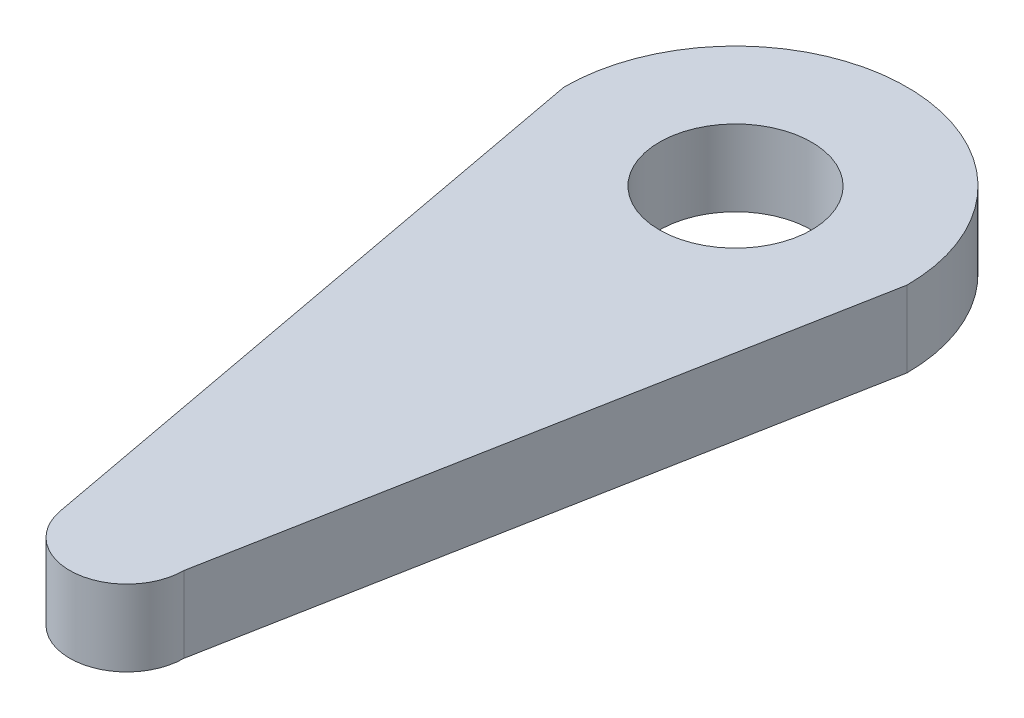
ISO-10303-21;
HEADER;
FILE_DESCRIPTION(('STEP AP214'),'2;1');
FILE_NAME('part.step','',(''),(''),'','','');
FILE_SCHEMA(('AUTOMOTIVE_DESIGN { 1 0 10303 214 1 1 1 1 }'));
ENDSEC;
DATA;
#1=APPLICATION_CONTEXT('core data for automotive mechanical design processes');
#2=APPLICATION_PROTOCOL_DEFINITION('international standard','automotive_design',2000,#1);
#3=PRODUCT_CONTEXT('',#1,'mechanical');
#4=PRODUCT('Part','Part','',(#3));
#5=PRODUCT_RELATED_PRODUCT_CATEGORY('part','',(#4));
#6=PRODUCT_DEFINITION_FORMATION('','',#4);
#7=PRODUCT_DEFINITION_CONTEXT('part definition',#1,'design');
#8=PRODUCT_DEFINITION('design','',#6,#7);
#9=PRODUCT_DEFINITION_SHAPE('','',#8);
#10=(LENGTH_UNIT() NAMED_UNIT(*) SI_UNIT(.MILLI.,.METRE.));
#11=(NAMED_UNIT(*) PLANE_ANGLE_UNIT() SI_UNIT($,.RADIAN.));
#12=(NAMED_UNIT(*) SI_UNIT($,.STERADIAN.) SOLID_ANGLE_UNIT());
#13=UNCERTAINTY_MEASURE_WITH_UNIT(LENGTH_MEASURE(1.E-05),#10,'distance_accuracy_value','');
#14=(GEOMETRIC_REPRESENTATION_CONTEXT(3) GLOBAL_UNCERTAINTY_ASSIGNED_CONTEXT((#13)) GLOBAL_UNIT_ASSIGNED_CONTEXT((#10,
#11,#12)) REPRESENTATION_CONTEXT('',''));
#15=CARTESIAN_POINT('',(0.,0.,0.));
#16=DIRECTION('',(0.,0.,1.));
#17=DIRECTION('',(1.,0.,0.));
#18=AXIS2_PLACEMENT_3D('',#15,#16,#17);
#19=CARTESIAN_POINT('',(0.,2.,0.));
#20=DIRECTION('',(0.,-1.,0.));
#21=DIRECTION('',(0.,0.,-1.));
#22=AXIS2_PLACEMENT_3D('',#19,#20,#21);
#23=CYLINDRICAL_SURFACE('',#22,4.50790916094944);
#24=CARTESIAN_POINT('',(0.,0.,0.));
#25=DIRECTION('',(0.,1.,0.));
#26=DIRECTION('',(0.,0.,1.));
#27=AXIS2_PLACEMENT_3D('',#24,#25,#26);
#28=CIRCLE('',#27,4.50790916094944);
#29=CARTESIAN_POINT('',(4.50790916094944,0.,0.));
#30=VERTEX_POINT('',#29);
#31=CARTESIAN_POINT('',(-4.50790916094944,0.,0.));
#32=VERTEX_POINT('',#31);
#33=EDGE_CURVE('E106',#30,#32,#28,.T.);
#34=ORIENTED_EDGE('',*,*,#33,.T.);
#35=DIRECTION('',(0.,-1.,0.));
#36=VECTOR('',#35,1.);
#37=CARTESIAN_POINT('',(-4.50790916094944,2.,0.));
#38=LINE('',#37,#36);
#39=CARTESIAN_POINT('',(-4.50790916094944,2.,0.));
#40=VERTEX_POINT('',#39);
#41=EDGE_CURVE('E11',#40,#32,#38,.T.);
#42=ORIENTED_EDGE('',*,*,#41,.F.);
#43=CARTESIAN_POINT('',(0.,2.,0.));
#44=DIRECTION('',(0.,1.,0.));
#45=DIRECTION('',(0.,0.,1.));
#46=AXIS2_PLACEMENT_3D('',#43,#44,#45);
#47=CIRCLE('',#46,4.50790916094944);
#48=CARTESIAN_POINT('',(4.50790916094944,2.,0.));
#49=VERTEX_POINT('',#48);
#50=EDGE_CURVE('E90',#49,#40,#47,.T.);
#51=ORIENTED_EDGE('',*,*,#50,.F.);
#52=DIRECTION('',(0.,-1.,0.));
#53=VECTOR('',#52,1.);
#54=CARTESIAN_POINT('',(4.50790916094944,2.,0.));
#55=LINE('',#54,#53);
#56=EDGE_CURVE('E102',#49,#30,#55,.T.);
#57=ORIENTED_EDGE('',*,*,#56,.T.);
#58=EDGE_LOOP('',(#34,#42,#51,#57));
#59=FACE_BOUND('',#58,.T.);
#60=ADVANCED_FACE('F38',(#59),#23,.T.);
#61=CARTESIAN_POINT('',(-4.50790916094944,2.,0.));
#62=DIRECTION('',(0.983100228081169,0.,-0.183068133619026));
#63=DIRECTION('',(-0.183068133619026,0.,-0.983100228081169));
#64=AXIS2_PLACEMENT_3D('',#61,#62,#63);
#65=PLANE('',#64);
#66=DIRECTION('',(0.183068133619026,0.,0.983100228081169));
#67=VECTOR('',#66,1.);
#68=CARTESIAN_POINT('',(-4.50790916094944,0.,0.));
#69=LINE('',#68,#67);
#70=CARTESIAN_POINT('',(-1.47724217418717,0.,16.2750848387652));
#71=VERTEX_POINT('',#70);
#72=EDGE_CURVE('E95',#32,#71,#69,.T.);
#73=ORIENTED_EDGE('',*,*,#72,.T.);
#74=DIRECTION('',(0.,-1.,0.));
#75=VECTOR('',#74,1.);
#76=CARTESIAN_POINT('',(-1.47724217418717,2.,16.2750848387652));
#77=LINE('',#76,#75);
#78=CARTESIAN_POINT('',(-1.47724217418717,2.,16.2750848387652));
#79=VERTEX_POINT('',#78);
#80=EDGE_CURVE('E47',#79,#71,#77,.T.);
#81=ORIENTED_EDGE('',*,*,#80,.F.);
#82=DIRECTION('',(0.183068133619026,0.,0.983100228081169));
#83=VECTOR('',#82,1.);
#84=CARTESIAN_POINT('',(-4.50790916094944,2.,0.));
#85=LINE('',#84,#83);
#86=EDGE_CURVE('E85',#40,#79,#85,.T.);
#87=ORIENTED_EDGE('',*,*,#86,.F.);
#88=ORIENTED_EDGE('',*,*,#41,.T.);
#89=EDGE_LOOP('',(#73,#81,#87,#88));
#90=FACE_BOUND('',#89,.T.);
#91=ADVANCED_FACE('F94',(#90),#65,.F.);
#92=CARTESIAN_POINT('',(0.,2.,16.));
#93=DIRECTION('',(0.,-1.,0.));
#94=DIRECTION('',(0.,0.,-1.));
#95=AXIS2_PLACEMENT_3D('',#92,#93,#94);
#96=CYLINDRICAL_SURFACE('',#95,1.50263638639417);
#97=CARTESIAN_POINT('',(0.,0.,16.));
#98=DIRECTION('',(0.,1.,0.));
#99=DIRECTION('',(0.,0.,1.));
#100=AXIS2_PLACEMENT_3D('',#97,#98,#99);
#101=CIRCLE('',#100,1.50263638639417);
#102=CARTESIAN_POINT('',(1.50263638639417,0.,16.));
#103=VERTEX_POINT('',#102);
#104=EDGE_CURVE('E72',#71,#103,#101,.T.);
#105=ORIENTED_EDGE('',*,*,#104,.T.);
#106=DIRECTION('',(0.,-1.,0.));
#107=VECTOR('',#106,1.);
#108=CARTESIAN_POINT('',(1.50263638639417,2.,16.));
#109=LINE('',#108,#107);
#110=CARTESIAN_POINT('',(1.50263638639417,2.,16.));
#111=VERTEX_POINT('',#110);
#112=EDGE_CURVE('E97',#111,#103,#109,.T.);
#113=ORIENTED_EDGE('',*,*,#112,.F.);
#114=CARTESIAN_POINT('',(0.,2.,16.));
#115=DIRECTION('',(0.,1.,0.));
#116=DIRECTION('',(0.,0.,1.));
#117=AXIS2_PLACEMENT_3D('',#114,#115,#116);
#118=CIRCLE('',#117,1.50263638639417);
#119=EDGE_CURVE('E88',#79,#111,#118,.T.);
#120=ORIENTED_EDGE('',*,*,#119,.F.);
#121=ORIENTED_EDGE('',*,*,#80,.T.);
#122=EDGE_LOOP('',(#105,#113,#120,#121));
#123=FACE_BOUND('',#122,.T.);
#124=ADVANCED_FACE('F98',(#123),#96,.T.);
#125=CARTESIAN_POINT('',(4.50790916094944,2.,0.));
#126=DIRECTION('',(-0.982813471240097,0.,-0.184601410474001));
#127=DIRECTION('',(-0.184601410474001,0.,0.982813471240097));
#128=AXIS2_PLACEMENT_3D('',#125,#126,#127);
#129=PLANE('',#128);
#130=DIRECTION('',(0.184601410474001,0.,-0.982813471240097));
#131=VECTOR('',#130,1.);
#132=CARTESIAN_POINT('',(4.50790916094944,0.,0.));
#133=LINE('',#132,#131);
#134=EDGE_CURVE('E78',#103,#30,#133,.T.);
#135=ORIENTED_EDGE('',*,*,#134,.T.);
#136=ORIENTED_EDGE('',*,*,#56,.F.);
#137=DIRECTION('',(0.184601410474001,0.,-0.982813471240097));
#138=VECTOR('',#137,1.);
#139=CARTESIAN_POINT('',(4.50790916094944,2.,0.));
#140=LINE('',#139,#138);
#141=EDGE_CURVE('E55',#111,#49,#140,.T.);
#142=ORIENTED_EDGE('',*,*,#141,.F.);
#143=ORIENTED_EDGE('',*,*,#112,.T.);
#144=EDGE_LOOP('',(#135,#136,#142,#143));
#145=FACE_BOUND('',#144,.T.);
#146=ADVANCED_FACE('F120',(#145),#129,.F.);
#147=CARTESIAN_POINT('',(0.,2.,0.));
#148=DIRECTION('',(0.,1.,0.));
#149=DIRECTION('',(0.,0.,1.));
#150=AXIS2_PLACEMENT_3D('',#147,#148,#149);
#151=PLANE('',#150);
#152=CARTESIAN_POINT('',(0.,2.,0.));
#153=DIRECTION('',(0.,1.,0.));
#154=DIRECTION('',(0.,0.,1.));
#155=AXIS2_PLACEMENT_3D('',#152,#153,#154);
#156=CIRCLE('',#155,2.);
#157=CARTESIAN_POINT('',(0.,2.,2.));
#158=VERTEX_POINT('',#157);
#159=EDGE_CURVE('E127',#158,#158,#156,.T.);
#160=ORIENTED_EDGE('',*,*,#159,.F.);
#161=EDGE_LOOP('',(#160));
#162=FACE_BOUND('',#161,.T.);
#163=ORIENTED_EDGE('',*,*,#50,.T.);
#164=ORIENTED_EDGE('',*,*,#86,.T.);
#165=ORIENTED_EDGE('',*,*,#119,.T.);
#166=ORIENTED_EDGE('',*,*,#141,.T.);
#167=EDGE_LOOP('',(#163,#164,#165,#166));
#168=FACE_BOUND('',#167,.T.);
#169=ADVANCED_FACE('F86',(#162,#168),#151,.T.);
#170=CARTESIAN_POINT('',(0.,0.,0.));
#171=DIRECTION('',(0.,1.,0.));
#172=DIRECTION('',(0.,0.,1.));
#173=AXIS2_PLACEMENT_3D('',#170,#171,#172);
#174=PLANE('',#173);
#175=CARTESIAN_POINT('',(0.,0.,0.));
#176=DIRECTION('',(0.,1.,0.));
#177=DIRECTION('',(0.,0.,1.));
#178=AXIS2_PLACEMENT_3D('',#175,#176,#177);
#179=CIRCLE('',#178,2.);
#180=CARTESIAN_POINT('',(0.,0.,2.));
#181=VERTEX_POINT('',#180);
#182=EDGE_CURVE('E110',#181,#181,#179,.T.);
#183=ORIENTED_EDGE('',*,*,#182,.T.);
#184=EDGE_LOOP('',(#183));
#185=FACE_BOUND('',#184,.T.);
#186=ORIENTED_EDGE('',*,*,#33,.F.);
#187=ORIENTED_EDGE('',*,*,#134,.F.);
#188=ORIENTED_EDGE('',*,*,#104,.F.);
#189=ORIENTED_EDGE('',*,*,#72,.F.);
#190=EDGE_LOOP('',(#186,#187,#188,#189));
#191=FACE_BOUND('',#190,.T.);
#192=ADVANCED_FACE('F123',(#185,#191),#174,.F.);
#193=CARTESIAN_POINT('',(0.,0.,0.));
#194=DIRECTION('',(0.,1.,0.));
#195=DIRECTION('',(0.,0.,1.));
#196=AXIS2_PLACEMENT_3D('',#193,#194,#195);
#197=CYLINDRICAL_SURFACE('',#196,2.);
#198=ORIENTED_EDGE('',*,*,#182,.F.);
#199=EDGE_LOOP('',(#198));
#200=FACE_BOUND('',#199,.T.);
#201=ORIENTED_EDGE('',*,*,#159,.T.);
#202=EDGE_LOOP('',(#201));
#203=FACE_BOUND('',#202,.T.);
#204=ADVANCED_FACE('F136',(#200,#203),#197,.F.);
#205=CLOSED_SHELL('',(#60,#91,#124,#146,#169,#192,#204));
#206=MANIFOLD_SOLID_BREP('B2',#205);
#207=ADVANCED_BREP_SHAPE_REPRESENTATION('',(#18,#206),#14);
#208=SHAPE_DEFINITION_REPRESENTATION(#9,#207);
ENDSEC;
END-ISO-10303-21;
